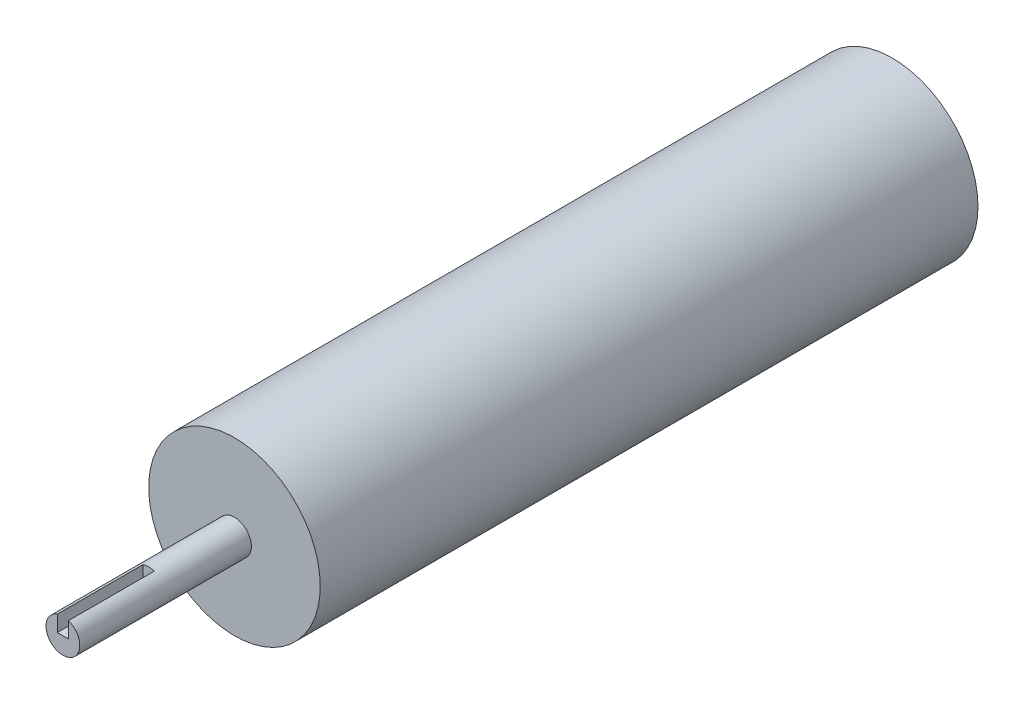
ISO-10303-21;
HEADER;
FILE_DESCRIPTION(('STEP AP214'),'2;1');
FILE_NAME('part.step','',(''),(''),'','','');
FILE_SCHEMA(('AUTOMOTIVE_DESIGN { 1 0 10303 214 1 1 1 1 }'));
ENDSEC;
DATA;
#1=APPLICATION_CONTEXT('core data for automotive mechanical design processes');
#2=APPLICATION_PROTOCOL_DEFINITION('international standard','automotive_design',2000,#1);
#3=PRODUCT_CONTEXT('',#1,'mechanical');
#4=PRODUCT('Part','Part','',(#3));
#5=PRODUCT_RELATED_PRODUCT_CATEGORY('part','',(#4));
#6=PRODUCT_DEFINITION_FORMATION('','',#4);
#7=PRODUCT_DEFINITION_CONTEXT('part definition',#1,'design');
#8=PRODUCT_DEFINITION('design','',#6,#7);
#9=PRODUCT_DEFINITION_SHAPE('','',#8);
#10=(LENGTH_UNIT() NAMED_UNIT(*) SI_UNIT(.MILLI.,.METRE.));
#11=(NAMED_UNIT(*) PLANE_ANGLE_UNIT() SI_UNIT($,.RADIAN.));
#12=(NAMED_UNIT(*) SI_UNIT($,.STERADIAN.) SOLID_ANGLE_UNIT());
#13=UNCERTAINTY_MEASURE_WITH_UNIT(LENGTH_MEASURE(1.E-05),#10,'distance_accuracy_value','');
#14=(GEOMETRIC_REPRESENTATION_CONTEXT(3) GLOBAL_UNCERTAINTY_ASSIGNED_CONTEXT((#13)) GLOBAL_UNIT_ASSIGNED_CONTEXT((#10,
#11,#12)) REPRESENTATION_CONTEXT('',''));
#15=CARTESIAN_POINT('',(0.,0.,0.));
#16=DIRECTION('',(0.,0.,1.));
#17=DIRECTION('',(1.,0.,0.));
#18=AXIS2_PLACEMENT_3D('',#15,#16,#17);
#19=CARTESIAN_POINT('',(0.,0.,368.3));
#20=DIRECTION('',(0.,0.,-1.));
#21=DIRECTION('',(-1.,0.,0.));
#22=AXIS2_PLACEMENT_3D('',#19,#20,#21);
#23=CYLINDRICAL_SURFACE('',#22,7.5);
#24=CARTESIAN_POINT('',(0.,0.,292.1));
#25=DIRECTION('',(0.,0.,1.));
#26=DIRECTION('',(1.,0.,0.));
#27=AXIS2_PLACEMENT_3D('',#24,#25,#26);
#28=CIRCLE('',#27,7.5);
#29=CARTESIAN_POINT('',(7.5,0.,292.1));
#30=VERTEX_POINT('',#29);
#31=EDGE_CURVE('E55',#30,#30,#28,.T.);
#32=ORIENTED_EDGE('',*,*,#31,.T.);
#33=EDGE_LOOP('',(#32));
#34=FACE_BOUND('',#33,.T.);
#35=DIRECTION('',(0.,0.,-1.));
#36=VECTOR('',#35,1.);
#37=CARTESIAN_POINT('',(2.5,7.07106781186548,943.227251519186));
#38=LINE('',#37,#36);
#39=CARTESIAN_POINT('',(2.5,7.07106781186548,368.3));
#40=VERTEX_POINT('',#39);
#41=CARTESIAN_POINT('',(2.5,7.07106781186548,330.2));
#42=VERTEX_POINT('',#41);
#43=EDGE_CURVE('E108',#40,#42,#38,.T.);
#44=ORIENTED_EDGE('',*,*,#43,.F.);
#45=CARTESIAN_POINT('',(0.,0.,368.3));
#46=DIRECTION('',(0.,0.,1.));
#47=DIRECTION('',(1.,0.,0.));
#48=AXIS2_PLACEMENT_3D('',#45,#46,#47);
#49=CIRCLE('',#48,7.5);
#50=CARTESIAN_POINT('',(-2.5,7.07106781186548,368.3));
#51=VERTEX_POINT('',#50);
#52=EDGE_CURVE('E126',#51,#40,#49,.T.);
#53=ORIENTED_EDGE('',*,*,#52,.F.);
#54=DIRECTION('',(0.,0.,-1.));
#55=VECTOR('',#54,1.);
#56=CARTESIAN_POINT('',(-2.5,7.07106781186548,943.227251519186));
#57=LINE('',#56,#55);
#58=CARTESIAN_POINT('',(-2.5,7.07106781186548,330.2));
#59=VERTEX_POINT('',#58);
#60=EDGE_CURVE('E70',#51,#59,#57,.T.);
#61=ORIENTED_EDGE('',*,*,#60,.T.);
#62=CARTESIAN_POINT('',(0.,0.,330.2));
#63=DIRECTION('',(0.,0.,1.));
#64=DIRECTION('',(1.,0.,0.));
#65=AXIS2_PLACEMENT_3D('',#62,#63,#64);
#66=CIRCLE('',#65,7.5);
#67=EDGE_CURVE('E94',#42,#59,#66,.T.);
#68=ORIENTED_EDGE('',*,*,#67,.F.);
#69=EDGE_LOOP('',(#44,#53,#61,#68));
#70=FACE_BOUND('',#69,.T.);
#71=ADVANCED_FACE('F45',(#34,#70),#23,.T.);
#72=CARTESIAN_POINT('',(0.,0.,292.1));
#73=DIRECTION('',(0.,0.,-1.));
#74=DIRECTION('',(-1.,0.,0.));
#75=AXIS2_PLACEMENT_3D('',#72,#73,#74);
#76=CYLINDRICAL_SURFACE('',#75,38.1);
#77=CARTESIAN_POINT('',(0.,0.,292.1));
#78=DIRECTION('',(0.,0.,1.));
#79=DIRECTION('',(1.,0.,0.));
#80=AXIS2_PLACEMENT_3D('',#77,#78,#79);
#81=CIRCLE('',#80,38.1);
#82=CARTESIAN_POINT('',(38.1,0.,292.1));
#83=VERTEX_POINT('',#82);
#84=EDGE_CURVE('E132',#83,#83,#81,.T.);
#85=ORIENTED_EDGE('',*,*,#84,.F.);
#86=EDGE_LOOP('',(#85));
#87=FACE_BOUND('',#86,.T.);
#88=CARTESIAN_POINT('',(0.,0.,0.));
#89=DIRECTION('',(0.,0.,1.));
#90=DIRECTION('',(1.,0.,0.));
#91=AXIS2_PLACEMENT_3D('',#88,#89,#90);
#92=CIRCLE('',#91,38.1);
#93=CARTESIAN_POINT('',(38.1,0.,0.));
#94=VERTEX_POINT('',#93);
#95=EDGE_CURVE('E49',#94,#94,#92,.T.);
#96=ORIENTED_EDGE('',*,*,#95,.T.);
#97=EDGE_LOOP('',(#96));
#98=FACE_BOUND('',#97,.T.);
#99=ADVANCED_FACE('F47',(#87,#98),#76,.T.);
#100=CARTESIAN_POINT('',(0.,0.,292.1));
#101=DIRECTION('',(0.,0.,1.));
#102=DIRECTION('',(1.,0.,0.));
#103=AXIS2_PLACEMENT_3D('',#100,#101,#102);
#104=PLANE('',#103);
#105=ORIENTED_EDGE('',*,*,#31,.F.);
#106=EDGE_LOOP('',(#105));
#107=FACE_BOUND('',#106,.T.);
#108=ORIENTED_EDGE('',*,*,#84,.T.);
#109=EDGE_LOOP('',(#108));
#110=FACE_BOUND('',#109,.T.);
#111=ADVANCED_FACE('F145',(#107,#110),#104,.T.);
#112=CARTESIAN_POINT('',(0.,0.,0.));
#113=DIRECTION('',(0.,0.,1.));
#114=DIRECTION('',(1.,0.,0.));
#115=AXIS2_PLACEMENT_3D('',#112,#113,#114);
#116=PLANE('',#115);
#117=CARTESIAN_POINT('',(0.,0.,0.));
#118=DIRECTION('',(0.,0.,-1.));
#119=DIRECTION('',(-1.,0.,0.));
#120=AXIS2_PLACEMENT_3D('',#117,#118,#119);
#121=CIRCLE('',#120,7.5);
#122=CARTESIAN_POINT('',(-7.5,0.,0.));
#123=VERTEX_POINT('',#122);
#124=EDGE_CURVE('E11',#123,#123,#121,.T.);
#125=ORIENTED_EDGE('',*,*,#124,.F.);
#126=EDGE_LOOP('',(#125));
#127=FACE_BOUND('',#126,.T.);
#128=ORIENTED_EDGE('',*,*,#95,.F.);
#129=EDGE_LOOP('',(#128));
#130=FACE_BOUND('',#129,.T.);
#131=ADVANCED_FACE('F142',(#127,#130),#116,.F.);
#132=CARTESIAN_POINT('',(0.,0.,368.3));
#133=DIRECTION('',(0.,0.,1.));
#134=DIRECTION('',(1.,0.,0.));
#135=AXIS2_PLACEMENT_3D('',#132,#133,#134);
#136=PLANE('',#135);
#137=DIRECTION('',(0.,1.,0.));
#138=VECTOR('',#137,1.);
#139=CARTESIAN_POINT('',(2.5,0.,368.3));
#140=LINE('',#139,#138);
#141=CARTESIAN_POINT('',(2.5,0.,368.3));
#142=VERTEX_POINT('',#141);
#143=EDGE_CURVE('E119',#142,#40,#140,.T.);
#144=ORIENTED_EDGE('',*,*,#143,.F.);
#145=DIRECTION('',(1.,0.,0.));
#146=VECTOR('',#145,1.);
#147=CARTESIAN_POINT('',(-2.5,0.,368.3));
#148=LINE('',#147,#146);
#149=CARTESIAN_POINT('',(-2.5,0.,368.3));
#150=VERTEX_POINT('',#149);
#151=EDGE_CURVE('E122',#150,#142,#148,.T.);
#152=ORIENTED_EDGE('',*,*,#151,.F.);
#153=DIRECTION('',(0.,-1.,0.));
#154=VECTOR('',#153,1.);
#155=CARTESIAN_POINT('',(-2.5,0.,368.3));
#156=LINE('',#155,#154);
#157=EDGE_CURVE('E105',#51,#150,#156,.T.);
#158=ORIENTED_EDGE('',*,*,#157,.F.);
#159=ORIENTED_EDGE('',*,*,#52,.T.);
#160=EDGE_LOOP('',(#144,#152,#158,#159));
#161=FACE_BOUND('',#160,.T.);
#162=ADVANCED_FACE('F144',(#161),#136,.T.);
#163=CARTESIAN_POINT('',(2.5,0.,943.227251519186));
#164=DIRECTION('',(-1.,0.,0.));
#165=DIRECTION('',(0.,0.,1.));
#166=AXIS2_PLACEMENT_3D('',#163,#164,#165);
#167=PLANE('',#166);
#168=DIRECTION('',(0.,0.,-1.));
#169=VECTOR('',#168,1.);
#170=CARTESIAN_POINT('',(2.5,0.,943.227251519186));
#171=LINE('',#170,#169);
#172=CARTESIAN_POINT('',(2.5,0.,330.2));
#173=VERTEX_POINT('',#172);
#174=EDGE_CURVE('E100',#142,#173,#171,.T.);
#175=ORIENTED_EDGE('',*,*,#174,.F.);
#176=ORIENTED_EDGE('',*,*,#143,.T.);
#177=ORIENTED_EDGE('',*,*,#43,.T.);
#178=DIRECTION('',(0.,1.,0.));
#179=VECTOR('',#178,1.);
#180=CARTESIAN_POINT('',(2.5,0.,330.2));
#181=LINE('',#180,#179);
#182=EDGE_CURVE('E102',#173,#42,#181,.T.);
#183=ORIENTED_EDGE('',*,*,#182,.F.);
#184=EDGE_LOOP('',(#175,#176,#177,#183));
#185=FACE_BOUND('',#184,.T.);
#186=ADVANCED_FACE('F152',(#185),#167,.T.);
#187=CARTESIAN_POINT('',(-2.5,0.,943.227251519186));
#188=DIRECTION('',(0.,1.,0.));
#189=DIRECTION('',(-1.,0.,0.));
#190=AXIS2_PLACEMENT_3D('',#187,#188,#189);
#191=PLANE('',#190);
#192=DIRECTION('',(0.,0.,-1.));
#193=VECTOR('',#192,1.);
#194=CARTESIAN_POINT('',(-2.5,0.,943.227251519186));
#195=LINE('',#194,#193);
#196=CARTESIAN_POINT('',(-2.5,0.,330.2));
#197=VERTEX_POINT('',#196);
#198=EDGE_CURVE('E63',#150,#197,#195,.T.);
#199=ORIENTED_EDGE('',*,*,#198,.F.);
#200=ORIENTED_EDGE('',*,*,#151,.T.);
#201=ORIENTED_EDGE('',*,*,#174,.T.);
#202=DIRECTION('',(1.,0.,0.));
#203=VECTOR('',#202,1.);
#204=CARTESIAN_POINT('',(-2.5,0.,330.2));
#205=LINE('',#204,#203);
#206=EDGE_CURVE('E91',#197,#173,#205,.T.);
#207=ORIENTED_EDGE('',*,*,#206,.F.);
#208=EDGE_LOOP('',(#199,#200,#201,#207));
#209=FACE_BOUND('',#208,.T.);
#210=ADVANCED_FACE('F98',(#209),#191,.T.);
#211=CARTESIAN_POINT('',(-2.5,0.,943.227251519186));
#212=DIRECTION('',(1.,0.,0.));
#213=DIRECTION('',(0.,0.,-1.));
#214=AXIS2_PLACEMENT_3D('',#211,#212,#213);
#215=PLANE('',#214);
#216=ORIENTED_EDGE('',*,*,#60,.F.);
#217=ORIENTED_EDGE('',*,*,#157,.T.);
#218=ORIENTED_EDGE('',*,*,#198,.T.);
#219=DIRECTION('',(0.,-1.,0.));
#220=VECTOR('',#219,1.);
#221=CARTESIAN_POINT('',(-2.5,0.,330.2));
#222=LINE('',#221,#220);
#223=EDGE_CURVE('E89',#59,#197,#222,.T.);
#224=ORIENTED_EDGE('',*,*,#223,.F.);
#225=EDGE_LOOP('',(#216,#217,#218,#224));
#226=FACE_BOUND('',#225,.T.);
#227=ADVANCED_FACE('F104',(#226),#215,.T.);
#228=CARTESIAN_POINT('',(0.,0.,330.2));
#229=DIRECTION('',(0.,0.,1.));
#230=DIRECTION('',(1.,0.,0.));
#231=AXIS2_PLACEMENT_3D('',#228,#229,#230);
#232=PLANE('',#231);
#233=ORIENTED_EDGE('',*,*,#223,.T.);
#234=ORIENTED_EDGE('',*,*,#206,.T.);
#235=ORIENTED_EDGE('',*,*,#182,.T.);
#236=ORIENTED_EDGE('',*,*,#67,.T.);
#237=EDGE_LOOP('',(#233,#234,#235,#236));
#238=FACE_BOUND('',#237,.T.);
#239=ADVANCED_FACE('F90',(#238),#232,.T.);
#240=CARTESIAN_POINT('',(0.,0.,-11.));
#241=DIRECTION('',(0.,0.,1.));
#242=DIRECTION('',(1.,0.,0.));
#243=AXIS2_PLACEMENT_3D('',#240,#241,#242);
#244=CYLINDRICAL_SURFACE('',#243,7.5);
#245=CARTESIAN_POINT('',(0.,0.,-11.));
#246=DIRECTION('',(0.,0.,-1.));
#247=DIRECTION('',(-1.,0.,0.));
#248=AXIS2_PLACEMENT_3D('',#245,#246,#247);
#249=CIRCLE('',#248,7.5);
#250=CARTESIAN_POINT('',(-7.5,0.,-11.));
#251=VERTEX_POINT('',#250);
#252=EDGE_CURVE('E125',#251,#251,#249,.T.);
#253=ORIENTED_EDGE('',*,*,#252,.F.);
#254=EDGE_LOOP('',(#253));
#255=FACE_BOUND('',#254,.T.);
#256=ORIENTED_EDGE('',*,*,#124,.T.);
#257=EDGE_LOOP('',(#256));
#258=FACE_BOUND('',#257,.T.);
#259=ADVANCED_FACE('F169',(#255,#258),#244,.T.);
#260=CARTESIAN_POINT('',(0.,0.,-11.));
#261=DIRECTION('',(0.,0.,-1.));
#262=DIRECTION('',(-1.,0.,0.));
#263=AXIS2_PLACEMENT_3D('',#260,#261,#262);
#264=PLANE('',#263);
#265=ORIENTED_EDGE('',*,*,#252,.T.);
#266=EDGE_LOOP('',(#265));
#267=FACE_BOUND('',#266,.T.);
#268=ADVANCED_FACE('F178',(#267),#264,.T.);
#269=CLOSED_SHELL('',(#71,#99,#111,#131,#162,#186,#210,#227,#239,#259,#268));
#270=MANIFOLD_SOLID_BREP('B2',#269);
#271=ADVANCED_BREP_SHAPE_REPRESENTATION('',(#18,#270),#14);
#272=SHAPE_DEFINITION_REPRESENTATION(#9,#271);
ENDSEC;
END-ISO-10303-21;
